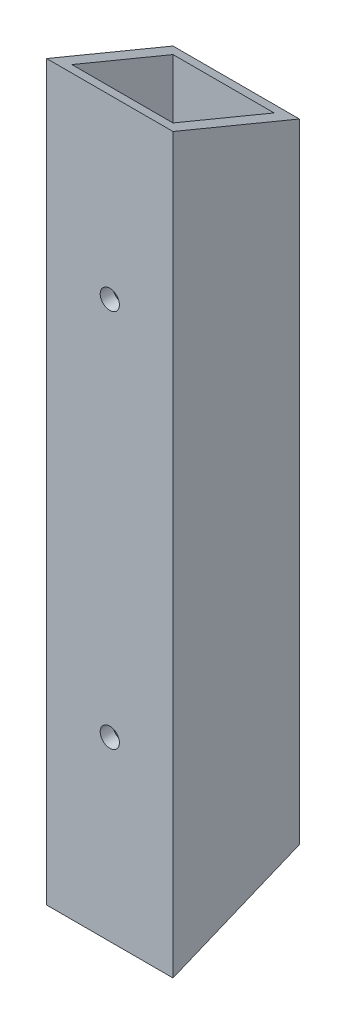
ISO-10303-21;
HEADER;
FILE_DESCRIPTION(('STEP AP214'),'2;1');
FILE_NAME('part.step','',(''),(''),'','','');
FILE_SCHEMA(('AUTOMOTIVE_DESIGN { 1 0 10303 214 1 1 1 1 }'));
ENDSEC;
DATA;
#1=APPLICATION_CONTEXT('core data for automotive mechanical design processes');
#2=APPLICATION_PROTOCOL_DEFINITION('international standard','automotive_design',2000,#1);
#3=PRODUCT_CONTEXT('',#1,'mechanical');
#4=PRODUCT('Part','Part','',(#3));
#5=PRODUCT_RELATED_PRODUCT_CATEGORY('part','',(#4));
#6=PRODUCT_DEFINITION_FORMATION('','',#4);
#7=PRODUCT_DEFINITION_CONTEXT('part definition',#1,'design');
#8=PRODUCT_DEFINITION('design','',#6,#7);
#9=PRODUCT_DEFINITION_SHAPE('','',#8);
#10=(LENGTH_UNIT() NAMED_UNIT(*) SI_UNIT(.MILLI.,.METRE.));
#11=(NAMED_UNIT(*) PLANE_ANGLE_UNIT() SI_UNIT($,.RADIAN.));
#12=(NAMED_UNIT(*) SI_UNIT($,.STERADIAN.) SOLID_ANGLE_UNIT());
#13=UNCERTAINTY_MEASURE_WITH_UNIT(LENGTH_MEASURE(1.E-05),#10,'distance_accuracy_value','');
#14=(GEOMETRIC_REPRESENTATION_CONTEXT(3) GLOBAL_UNCERTAINTY_ASSIGNED_CONTEXT((#13)) GLOBAL_UNIT_ASSIGNED_CONTEXT((#10,
#11,#12)) REPRESENTATION_CONTEXT('',''));
#15=CARTESIAN_POINT('',(0.,0.,0.));
#16=DIRECTION('',(0.,0.,1.));
#17=DIRECTION('',(1.,0.,0.));
#18=AXIS2_PLACEMENT_3D('',#15,#16,#17);
#19=CARTESIAN_POINT('',(15.875,139.7,0.));
#20=DIRECTION('',(0.,0.,1.));
#21=DIRECTION('',(1.,0.,0.));
#22=AXIS2_PLACEMENT_3D('',#19,#20,#21);
#23=CYLINDRICAL_SURFACE('',#22,2.413);
#24=CARTESIAN_POINT('',(15.875,139.7,-28.575));
#25=DIRECTION('',(0.,0.,1.));
#26=DIRECTION('',(1.,0.,0.));
#27=AXIS2_PLACEMENT_3D('',#24,#25,#26);
#28=CIRCLE('',#27,2.413);
#29=CARTESIAN_POINT('',(18.288,139.7,-28.575));
#30=VERTEX_POINT('',#29);
#31=EDGE_CURVE('E124',#30,#30,#28,.F.);
#32=ORIENTED_EDGE('',*,*,#31,.F.);
#33=EDGE_LOOP('',(#32));
#34=FACE_BOUND('',#33,.T.);
#35=CARTESIAN_POINT('',(15.875,139.7,-31.75));
#36=DIRECTION('',(0.,0.,1.));
#37=DIRECTION('',(1.,0.,0.));
#38=AXIS2_PLACEMENT_3D('',#35,#36,#37);
#39=CIRCLE('',#38,2.413);
#40=CARTESIAN_POINT('',(18.288,139.7,-31.75));
#41=VERTEX_POINT('',#40);
#42=EDGE_CURVE('E20',#41,#41,#39,.T.);
#43=ORIENTED_EDGE('',*,*,#42,.F.);
#44=EDGE_LOOP('',(#43));
#45=FACE_BOUND('',#44,.T.);
#46=ADVANCED_FACE('F17',(#34,#45),#23,.F.);
#47=CARTESIAN_POINT('',(15.875,44.45,0.));
#48=DIRECTION('',(0.,0.,1.));
#49=DIRECTION('',(1.,0.,0.));
#50=AXIS2_PLACEMENT_3D('',#47,#48,#49);
#51=CYLINDRICAL_SURFACE('',#50,2.413);
#52=CARTESIAN_POINT('',(15.875,44.45,-28.575));
#53=DIRECTION('',(0.,0.,1.));
#54=DIRECTION('',(1.,0.,0.));
#55=AXIS2_PLACEMENT_3D('',#52,#53,#54);
#56=CIRCLE('',#55,2.413);
#57=CARTESIAN_POINT('',(18.288,44.45,-28.575));
#58=VERTEX_POINT('',#57);
#59=EDGE_CURVE('E123',#58,#58,#56,.F.);
#60=ORIENTED_EDGE('',*,*,#59,.F.);
#61=EDGE_LOOP('',(#60));
#62=FACE_BOUND('',#61,.T.);
#63=CARTESIAN_POINT('',(15.875,44.45,-31.75));
#64=DIRECTION('',(0.,0.,1.));
#65=DIRECTION('',(1.,0.,0.));
#66=AXIS2_PLACEMENT_3D('',#63,#64,#65);
#67=CIRCLE('',#66,2.413);
#68=CARTESIAN_POINT('',(18.288,44.45,-31.75));
#69=VERTEX_POINT('',#68);
#70=EDGE_CURVE('E125',#69,#69,#67,.T.);
#71=ORIENTED_EDGE('',*,*,#70,.F.);
#72=EDGE_LOOP('',(#71));
#73=FACE_BOUND('',#72,.T.);
#74=ADVANCED_FACE('F150',(#62,#73),#51,.F.);
#75=CARTESIAN_POINT('',(31.75,0.,-31.75));
#76=DIRECTION('',(0.,0.,-1.));
#77=DIRECTION('',(-1.,0.,0.));
#78=AXIS2_PLACEMENT_3D('',#75,#76,#77);
#79=PLANE('',#78);
#80=ORIENTED_EDGE('',*,*,#70,.T.);
#81=EDGE_LOOP('',(#80));
#82=FACE_BOUND('',#81,.T.);
#83=ORIENTED_EDGE('',*,*,#42,.T.);
#84=EDGE_LOOP('',(#83));
#85=FACE_BOUND('',#84,.T.);
#86=DIRECTION('',(0.,1.,0.));
#87=VECTOR('',#86,1.);
#88=CARTESIAN_POINT('',(0.,0.,-31.75));
#89=LINE('',#88,#87);
#90=CARTESIAN_POINT('',(0.,170.998719394662,-31.7499999999992));
#91=VERTEX_POINT('',#90);
#92=CARTESIAN_POINT('',(0.,13.1512806053466,-31.75));
#93=VERTEX_POINT('',#92);
#94=EDGE_CURVE('E117',#91,#93,#89,.F.);
#95=ORIENTED_EDGE('',*,*,#94,.F.);
#96=DIRECTION('',(1.,0.,0.));
#97=VECTOR('',#96,1.);
#98=CARTESIAN_POINT('',(31.75,170.998719394655,-31.7499999999966));
#99=LINE('',#98,#97);
#100=CARTESIAN_POINT('',(31.75,170.998719394662,-31.7499999999992));
#101=VERTEX_POINT('',#100);
#102=EDGE_CURVE('E303',#91,#101,#99,.T.);
#103=ORIENTED_EDGE('',*,*,#102,.T.);
#104=DIRECTION('',(0.,1.,0.));
#105=VECTOR('',#104,1.);
#106=CARTESIAN_POINT('',(31.75,0.,-31.75));
#107=LINE('',#106,#105);
#108=CARTESIAN_POINT('',(31.75,13.1512806053466,-31.75));
#109=VERTEX_POINT('',#108);
#110=EDGE_CURVE('E308',#109,#101,#107,.T.);
#111=ORIENTED_EDGE('',*,*,#110,.F.);
#112=DIRECTION('',(1.,0.,0.));
#113=VECTOR('',#112,1.);
#114=CARTESIAN_POINT('',(31.75,13.1512806053466,-31.75));
#115=LINE('',#114,#113);
#116=EDGE_CURVE('E91',#109,#93,#115,.F.);
#117=ORIENTED_EDGE('',*,*,#116,.T.);
#118=EDGE_LOOP('',(#95,#103,#111,#117));
#119=FACE_BOUND('',#118,.T.);
#120=ADVANCED_FACE('F146',(#82,#85,#119),#79,.T.);
#121=CARTESIAN_POINT('',(28.575,0.,-28.575));
#122=DIRECTION('',(-1.,0.,0.));
#123=DIRECTION('',(0.,0.,1.));
#124=AXIS2_PLACEMENT_3D('',#121,#122,#123);
#125=PLANE('',#124);
#126=DIRECTION('',(0.,1.,0.));
#127=VECTOR('',#126,1.);
#128=CARTESIAN_POINT('',(28.575,0.,-3.175));
#129=LINE('',#128,#127);
#130=CARTESIAN_POINT('',(28.575,182.834871939458,-3.17500000000082));
#131=VERTEX_POINT('',#130);
#132=CARTESIAN_POINT('',(28.575,1.31512806053478,-3.17499999999995));
#133=VERTEX_POINT('',#132);
#134=EDGE_CURVE('E82',#131,#133,#129,.F.);
#135=ORIENTED_EDGE('',*,*,#134,.F.);
#136=DIRECTION('',(0.,-0.382683432365094,-0.923879532511285));
#137=VECTOR('',#136,1.);
#138=CARTESIAN_POINT('',(28.575,184.15,0.));
#139=LINE('',#138,#137);
#140=CARTESIAN_POINT('',(28.575,172.313847455183,-28.5750000000006));
#141=VERTEX_POINT('',#140);
#142=EDGE_CURVE('E295',#131,#141,#139,.T.);
#143=ORIENTED_EDGE('',*,*,#142,.T.);
#144=DIRECTION('',(0.,1.,0.));
#145=VECTOR('',#144,1.);
#146=CARTESIAN_POINT('',(28.575,0.,-28.575));
#147=LINE('',#146,#145);
#148=CARTESIAN_POINT('',(28.575,11.8361525448107,-28.5749999999999));
#149=VERTEX_POINT('',#148);
#150=EDGE_CURVE('E85',#149,#141,#147,.T.);
#151=ORIENTED_EDGE('',*,*,#150,.F.);
#152=DIRECTION('',(0.,-0.382683432365094,0.923879532511285));
#153=VECTOR('',#152,1.);
#154=CARTESIAN_POINT('',(28.575,13.1512806053466,-31.75));
#155=LINE('',#154,#153);
#156=EDGE_CURVE('E79',#149,#133,#155,.T.);
#157=ORIENTED_EDGE('',*,*,#156,.T.);
#158=EDGE_LOOP('',(#135,#143,#151,#157));
#159=FACE_BOUND('',#158,.T.);
#160=ADVANCED_FACE('F81',(#159),#125,.T.);
#161=CARTESIAN_POINT('',(3.175,0.,-28.575));
#162=DIRECTION('',(0.,0.,1.));
#163=DIRECTION('',(1.,0.,0.));
#164=AXIS2_PLACEMENT_3D('',#161,#162,#163);
#165=PLANE('',#164);
#166=ORIENTED_EDGE('',*,*,#59,.T.);
#167=EDGE_LOOP('',(#166));
#168=FACE_BOUND('',#167,.T.);
#169=ORIENTED_EDGE('',*,*,#31,.T.);
#170=EDGE_LOOP('',(#169));
#171=FACE_BOUND('',#170,.T.);
#172=ORIENTED_EDGE('',*,*,#150,.T.);
#173=DIRECTION('',(1.,0.,0.));
#174=VECTOR('',#173,1.);
#175=CARTESIAN_POINT('',(31.75,172.313847455188,-28.5750000000024));
#176=LINE('',#175,#174);
#177=CARTESIAN_POINT('',(3.175,172.313847455183,-28.5750000000006));
#178=VERTEX_POINT('',#177);
#179=EDGE_CURVE('E292',#141,#178,#176,.F.);
#180=ORIENTED_EDGE('',*,*,#179,.T.);
#181=DIRECTION('',(0.,1.,0.));
#182=VECTOR('',#181,1.);
#183=CARTESIAN_POINT('',(3.175,0.,-28.575));
#184=LINE('',#183,#182);
#185=CARTESIAN_POINT('',(3.175,11.8361525448107,-28.5749999999999));
#186=VERTEX_POINT('',#185);
#187=EDGE_CURVE('E102',#186,#178,#184,.T.);
#188=ORIENTED_EDGE('',*,*,#187,.F.);
#189=DIRECTION('',(1.,0.,0.));
#190=VECTOR('',#189,1.);
#191=CARTESIAN_POINT('',(31.75,11.8361525448117,-28.5749999999994));
#192=LINE('',#191,#190);
#193=EDGE_CURVE('E109',#186,#149,#192,.T.);
#194=ORIENTED_EDGE('',*,*,#193,.T.);
#195=EDGE_LOOP('',(#172,#180,#188,#194));
#196=FACE_BOUND('',#195,.T.);
#197=ADVANCED_FACE('F193',(#168,#171,#196),#165,.T.);
#198=CARTESIAN_POINT('',(3.175,0.,-3.175));
#199=DIRECTION('',(1.,0.,0.));
#200=DIRECTION('',(0.,0.,-1.));
#201=AXIS2_PLACEMENT_3D('',#198,#199,#200);
#202=PLANE('',#201);
#203=ORIENTED_EDGE('',*,*,#187,.T.);
#204=DIRECTION('',(0.,-0.382683432365094,-0.923879532511285));
#205=VECTOR('',#204,1.);
#206=CARTESIAN_POINT('',(3.175,184.15,0.));
#207=LINE('',#206,#205);
#208=CARTESIAN_POINT('',(3.175,182.834871939458,-3.17500000000081));
#209=VERTEX_POINT('',#208);
#210=EDGE_CURVE('E296',#178,#209,#207,.F.);
#211=ORIENTED_EDGE('',*,*,#210,.T.);
#212=DIRECTION('',(0.,1.,0.));
#213=VECTOR('',#212,1.);
#214=CARTESIAN_POINT('',(3.175,0.,-3.175));
#215=LINE('',#214,#213);
#216=CARTESIAN_POINT('',(3.175,1.31512806053478,-3.17499999999995));
#217=VERTEX_POINT('',#216);
#218=EDGE_CURVE('E101',#217,#209,#215,.T.);
#219=ORIENTED_EDGE('',*,*,#218,.F.);
#220=DIRECTION('',(0.,-0.382683432365094,0.923879532511285));
#221=VECTOR('',#220,1.);
#222=CARTESIAN_POINT('',(3.175,13.1512806053466,-31.75));
#223=LINE('',#222,#221);
#224=EDGE_CURVE('E107',#217,#186,#223,.F.);
#225=ORIENTED_EDGE('',*,*,#224,.T.);
#226=EDGE_LOOP('',(#203,#211,#219,#225));
#227=FACE_BOUND('',#226,.T.);
#228=ADVANCED_FACE('F189',(#227),#202,.T.);
#229=CARTESIAN_POINT('',(28.575,0.,-3.175));
#230=DIRECTION('',(0.,0.,-1.));
#231=DIRECTION('',(-1.,0.,0.));
#232=AXIS2_PLACEMENT_3D('',#229,#230,#231);
#233=PLANE('',#232);
#234=CARTESIAN_POINT('',(15.875,44.45,-3.175));
#235=DIRECTION('',(0.,0.,1.));
#236=DIRECTION('',(1.,0.,0.));
#237=AXIS2_PLACEMENT_3D('',#234,#235,#236);
#238=CIRCLE('',#237,2.413);
#239=CARTESIAN_POINT('',(18.288,44.45,-3.175));
#240=VERTEX_POINT('',#239);
#241=EDGE_CURVE('E130',#240,#240,#238,.T.);
#242=ORIENTED_EDGE('',*,*,#241,.T.);
#243=EDGE_LOOP('',(#242));
#244=FACE_BOUND('',#243,.T.);
#245=CARTESIAN_POINT('',(15.875,139.7,-3.175));
#246=DIRECTION('',(0.,0.,1.));
#247=DIRECTION('',(1.,0.,0.));
#248=AXIS2_PLACEMENT_3D('',#245,#246,#247);
#249=CIRCLE('',#248,2.413);
#250=CARTESIAN_POINT('',(18.288,139.7,-3.175));
#251=VERTEX_POINT('',#250);
#252=EDGE_CURVE('E134',#251,#251,#249,.T.);
#253=ORIENTED_EDGE('',*,*,#252,.T.);
#254=EDGE_LOOP('',(#253));
#255=FACE_BOUND('',#254,.T.);
#256=ORIENTED_EDGE('',*,*,#218,.T.);
#257=DIRECTION('',(1.,0.,0.));
#258=VECTOR('',#257,1.);
#259=CARTESIAN_POINT('',(31.75,182.834871939464,-3.17500000000325));
#260=LINE('',#259,#258);
#261=EDGE_CURVE('E99',#209,#131,#260,.T.);
#262=ORIENTED_EDGE('',*,*,#261,.T.);
#263=ORIENTED_EDGE('',*,*,#134,.T.);
#264=DIRECTION('',(1.,0.,0.));
#265=VECTOR('',#264,1.);
#266=CARTESIAN_POINT('',(31.75,1.31512806053514,-3.1749999999998));
#267=LINE('',#266,#265);
#268=EDGE_CURVE('E90',#133,#217,#267,.F.);
#269=ORIENTED_EDGE('',*,*,#268,.T.);
#270=EDGE_LOOP('',(#256,#262,#263,#269));
#271=FACE_BOUND('',#270,.T.);
#272=ADVANCED_FACE('F96',(#244,#255,#271),#233,.T.);
#273=CARTESIAN_POINT('',(0.,0.,-31.75));
#274=DIRECTION('',(-1.,0.,0.));
#275=DIRECTION('',(0.,0.,1.));
#276=AXIS2_PLACEMENT_3D('',#273,#274,#275);
#277=PLANE('',#276);
#278=DIRECTION('',(0.,1.,0.));
#279=VECTOR('',#278,1.);
#280=CARTESIAN_POINT('',(0.,0.,0.));
#281=LINE('',#280,#279);
#282=CARTESIAN_POINT('',(0.,184.15,0.));
#283=VERTEX_POINT('',#282);
#284=CARTESIAN_POINT('',(0.,1.34007388519208E-13,0.));
#285=VERTEX_POINT('',#284);
#286=EDGE_CURVE('E133',#283,#285,#281,.F.);
#287=ORIENTED_EDGE('',*,*,#286,.F.);
#288=DIRECTION('',(0.,-0.382683432365094,-0.923879532511285));
#289=VECTOR('',#288,1.);
#290=CARTESIAN_POINT('',(0.,184.15,0.));
#291=LINE('',#290,#289);
#292=EDGE_CURVE('E305',#283,#91,#291,.T.);
#293=ORIENTED_EDGE('',*,*,#292,.T.);
#294=ORIENTED_EDGE('',*,*,#94,.T.);
#295=DIRECTION('',(0.,-0.382683432365094,0.923879532511285));
#296=VECTOR('',#295,1.);
#297=CARTESIAN_POINT('',(0.,13.1512806053466,-31.75));
#298=LINE('',#297,#296);
#299=EDGE_CURVE('E115',#93,#285,#298,.T.);
#300=ORIENTED_EDGE('',*,*,#299,.T.);
#301=EDGE_LOOP('',(#287,#293,#294,#300));
#302=FACE_BOUND('',#301,.T.);
#303=ADVANCED_FACE('F183',(#302),#277,.T.);
#304=CARTESIAN_POINT('',(31.75,13.1512806053466,-31.75));
#305=DIRECTION('',(0.,0.923879532511285,0.382683432365094));
#306=DIRECTION('',(0.,-0.382683432365094,0.923879532511285));
#307=AXIS2_PLACEMENT_3D('',#304,#305,#306);
#308=PLANE('',#307);
#309=ORIENTED_EDGE('',*,*,#224,.F.);
#310=ORIENTED_EDGE('',*,*,#268,.F.);
#311=ORIENTED_EDGE('',*,*,#156,.F.);
#312=ORIENTED_EDGE('',*,*,#193,.F.);
#313=EDGE_LOOP('',(#309,#310,#311,#312));
#314=FACE_BOUND('',#313,.T.);
#315=DIRECTION('',(0.,0.382683432365109,-0.923879532511279));
#316=VECTOR('',#315,1.);
#317=CARTESIAN_POINT('',(31.75,0.,0.));
#318=LINE('',#317,#316);
#319=CARTESIAN_POINT('',(31.75,2.68014777038417E-13,1.11022302462516E-13));
#320=VERTEX_POINT('',#319);
#321=EDGE_CURVE('E310',#320,#109,#318,.T.);
#322=ORIENTED_EDGE('',*,*,#321,.F.);
#323=DIRECTION('',(1.,0.,0.));
#324=VECTOR('',#323,1.);
#325=CARTESIAN_POINT('',(0.,0.,0.));
#326=LINE('',#325,#324);
#327=EDGE_CURVE('E318',#285,#320,#326,.T.);
#328=ORIENTED_EDGE('',*,*,#327,.F.);
#329=ORIENTED_EDGE('',*,*,#299,.F.);
#330=ORIENTED_EDGE('',*,*,#116,.F.);
#331=EDGE_LOOP('',(#322,#328,#329,#330));
#332=FACE_BOUND('',#331,.T.);
#333=ADVANCED_FACE('F104',(#314,#332),#308,.F.);
#334=CARTESIAN_POINT('',(31.75,0.,0.));
#335=DIRECTION('',(1.,0.,0.));
#336=DIRECTION('',(0.,0.,-1.));
#337=AXIS2_PLACEMENT_3D('',#334,#335,#336);
#338=PLANE('',#337);
#339=ORIENTED_EDGE('',*,*,#110,.T.);
#340=DIRECTION('',(0.,-0.382683432365094,-0.923879532511285));
#341=VECTOR('',#340,1.);
#342=CARTESIAN_POINT('',(31.75,184.15,0.));
#343=LINE('',#342,#341);
#344=CARTESIAN_POINT('',(31.75,184.15,0.));
#345=VERTEX_POINT('',#344);
#346=EDGE_CURVE('E35',#101,#345,#343,.F.);
#347=ORIENTED_EDGE('',*,*,#346,.T.);
#348=DIRECTION('',(0.,1.,0.));
#349=VECTOR('',#348,1.);
#350=CARTESIAN_POINT('',(31.75,0.,0.));
#351=LINE('',#350,#349);
#352=EDGE_CURVE('E314',#320,#345,#351,.T.);
#353=ORIENTED_EDGE('',*,*,#352,.F.);
#354=ORIENTED_EDGE('',*,*,#321,.T.);
#355=EDGE_LOOP('',(#339,#347,#353,#354));
#356=FACE_BOUND('',#355,.T.);
#357=ADVANCED_FACE('F177',(#356),#338,.T.);
#358=CARTESIAN_POINT('',(31.75,184.15,0.));
#359=DIRECTION('',(0.,-0.923879532511285,0.382683432365094));
#360=DIRECTION('',(0.,-0.382683432365094,-0.923879532511285));
#361=AXIS2_PLACEMENT_3D('',#358,#359,#360);
#362=PLANE('',#361);
#363=ORIENTED_EDGE('',*,*,#210,.F.);
#364=ORIENTED_EDGE('',*,*,#179,.F.);
#365=ORIENTED_EDGE('',*,*,#142,.F.);
#366=ORIENTED_EDGE('',*,*,#261,.F.);
#367=EDGE_LOOP('',(#363,#364,#365,#366));
#368=FACE_BOUND('',#367,.T.);
#369=ORIENTED_EDGE('',*,*,#346,.F.);
#370=ORIENTED_EDGE('',*,*,#102,.F.);
#371=ORIENTED_EDGE('',*,*,#292,.F.);
#372=DIRECTION('',(1.,0.,0.));
#373=VECTOR('',#372,1.);
#374=CARTESIAN_POINT('',(0.,184.15,0.));
#375=LINE('',#374,#373);
#376=EDGE_CURVE('E129',#345,#283,#375,.F.);
#377=ORIENTED_EDGE('',*,*,#376,.F.);
#378=EDGE_LOOP('',(#369,#370,#371,#377));
#379=FACE_BOUND('',#378,.T.);
#380=ADVANCED_FACE('F173',(#368,#379),#362,.F.);
#381=CARTESIAN_POINT('',(15.875,139.7,0.));
#382=DIRECTION('',(0.,0.,1.));
#383=DIRECTION('',(1.,0.,0.));
#384=AXIS2_PLACEMENT_3D('',#381,#382,#383);
#385=CYLINDRICAL_SURFACE('',#384,2.413);
#386=ORIENTED_EDGE('',*,*,#252,.F.);
#387=EDGE_LOOP('',(#386));
#388=FACE_BOUND('',#387,.T.);
#389=CARTESIAN_POINT('',(15.875,139.7,0.));
#390=DIRECTION('',(0.,0.,1.));
#391=DIRECTION('',(1.,0.,0.));
#392=AXIS2_PLACEMENT_3D('',#389,#390,#391);
#393=CIRCLE('',#392,2.413);
#394=CARTESIAN_POINT('',(18.288,139.7,0.));
#395=VERTEX_POINT('',#394);
#396=EDGE_CURVE('E26',#395,#395,#393,.F.);
#397=ORIENTED_EDGE('',*,*,#396,.F.);
#398=EDGE_LOOP('',(#397));
#399=FACE_BOUND('',#398,.T.);
#400=ADVANCED_FACE('F166',(#388,#399),#385,.F.);
#401=CARTESIAN_POINT('',(15.875,44.45,0.));
#402=DIRECTION('',(0.,0.,1.));
#403=DIRECTION('',(1.,0.,0.));
#404=AXIS2_PLACEMENT_3D('',#401,#402,#403);
#405=CYLINDRICAL_SURFACE('',#404,2.413);
#406=ORIENTED_EDGE('',*,*,#241,.F.);
#407=EDGE_LOOP('',(#406));
#408=FACE_BOUND('',#407,.T.);
#409=CARTESIAN_POINT('',(15.875,44.45,0.));
#410=DIRECTION('',(0.,0.,1.));
#411=DIRECTION('',(1.,0.,0.));
#412=AXIS2_PLACEMENT_3D('',#409,#410,#411);
#413=CIRCLE('',#412,2.413);
#414=CARTESIAN_POINT('',(18.288,44.45,0.));
#415=VERTEX_POINT('',#414);
#416=EDGE_CURVE('E11',#415,#415,#413,.F.);
#417=ORIENTED_EDGE('',*,*,#416,.F.);
#418=EDGE_LOOP('',(#417));
#419=FACE_BOUND('',#418,.T.);
#420=ADVANCED_FACE('F160',(#408,#419),#405,.F.);
#421=CARTESIAN_POINT('',(0.,0.,0.));
#422=DIRECTION('',(0.,0.,1.));
#423=DIRECTION('',(1.,0.,0.));
#424=AXIS2_PLACEMENT_3D('',#421,#422,#423);
#425=PLANE('',#424);
#426=ORIENTED_EDGE('',*,*,#416,.T.);
#427=EDGE_LOOP('',(#426));
#428=FACE_BOUND('',#427,.T.);
#429=ORIENTED_EDGE('',*,*,#396,.T.);
#430=EDGE_LOOP('',(#429));
#431=FACE_BOUND('',#430,.T.);
#432=ORIENTED_EDGE('',*,*,#352,.T.);
#433=ORIENTED_EDGE('',*,*,#376,.T.);
#434=ORIENTED_EDGE('',*,*,#286,.T.);
#435=ORIENTED_EDGE('',*,*,#327,.T.);
#436=EDGE_LOOP('',(#432,#433,#434,#435));
#437=FACE_BOUND('',#436,.T.);
#438=ADVANCED_FACE('F158',(#428,#431,#437),#425,.T.);
#439=CLOSED_SHELL('',(#46,#74,#120,#160,#197,#228,#272,#303,#333,#357,#380,#400,#420,#438));
#440=MANIFOLD_SOLID_BREP('B1',#439);
#441=ADVANCED_BREP_SHAPE_REPRESENTATION('',(#18,#440),#14);
#442=SHAPE_DEFINITION_REPRESENTATION(#9,#441);
ENDSEC;
END-ISO-10303-21;
